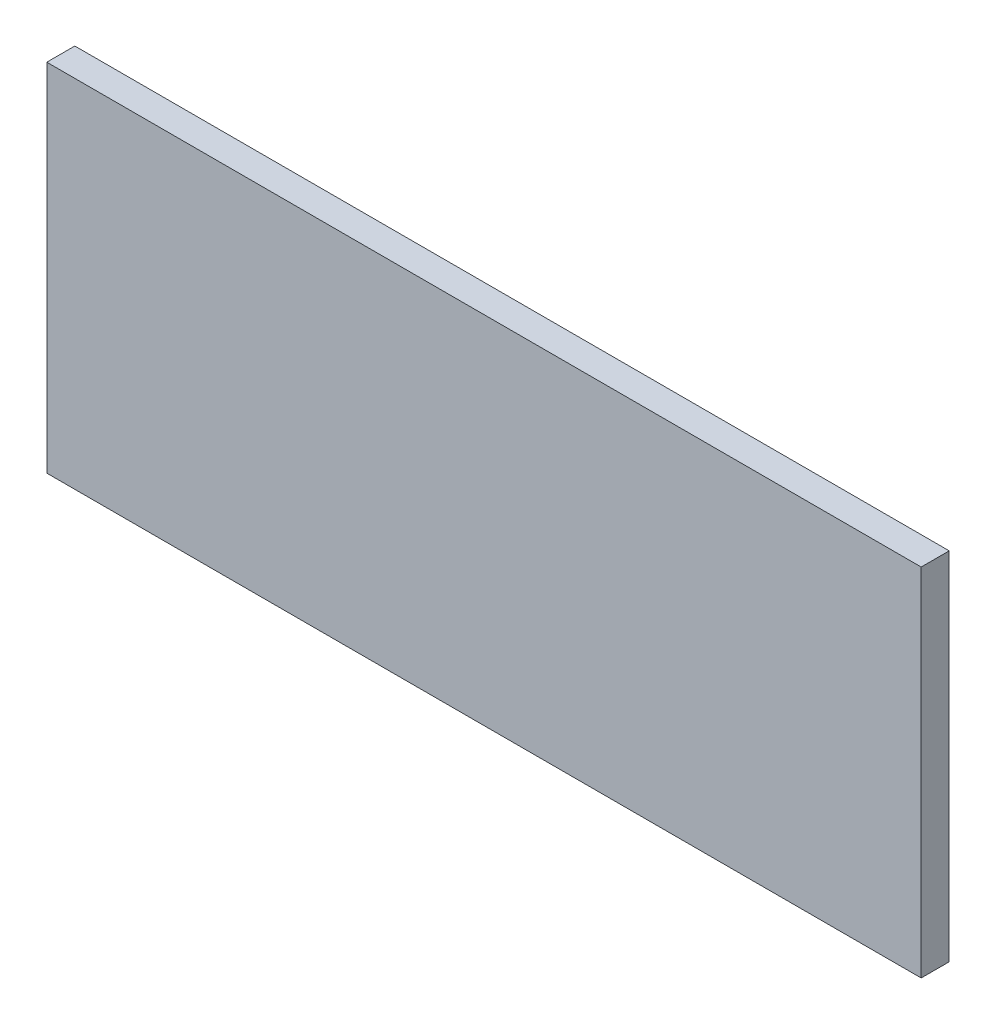
ISO-10303-21;
HEADER;
FILE_DESCRIPTION(('STEP AP214'),'2;1');
FILE_NAME('part.step','',(''),(''),'','','');
FILE_SCHEMA(('AUTOMOTIVE_DESIGN { 1 0 10303 214 1 1 1 1 }'));
ENDSEC;
DATA;
#1=APPLICATION_CONTEXT('core data for automotive mechanical design processes');
#2=APPLICATION_PROTOCOL_DEFINITION('international standard','automotive_design',2000,#1);
#3=PRODUCT_CONTEXT('',#1,'mechanical');
#4=PRODUCT('Part','Part','',(#3));
#5=PRODUCT_RELATED_PRODUCT_CATEGORY('part','',(#4));
#6=PRODUCT_DEFINITION_FORMATION('','',#4);
#7=PRODUCT_DEFINITION_CONTEXT('part definition',#1,'design');
#8=PRODUCT_DEFINITION('design','',#6,#7);
#9=PRODUCT_DEFINITION_SHAPE('','',#8);
#10=(LENGTH_UNIT() NAMED_UNIT(*) SI_UNIT(.MILLI.,.METRE.));
#11=(NAMED_UNIT(*) PLANE_ANGLE_UNIT() SI_UNIT($,.RADIAN.));
#12=(NAMED_UNIT(*) SI_UNIT($,.STERADIAN.) SOLID_ANGLE_UNIT());
#13=UNCERTAINTY_MEASURE_WITH_UNIT(LENGTH_MEASURE(1.E-05),#10,'distance_accuracy_value','');
#14=(GEOMETRIC_REPRESENTATION_CONTEXT(3) GLOBAL_UNCERTAINTY_ASSIGNED_CONTEXT((#13)) GLOBAL_UNIT_ASSIGNED_CONTEXT((#10,
#11,#12)) REPRESENTATION_CONTEXT('',''));
#15=CARTESIAN_POINT('',(0.,0.,0.));
#16=DIRECTION('',(0.,0.,1.));
#17=DIRECTION('',(1.,0.,0.));
#18=AXIS2_PLACEMENT_3D('',#15,#16,#17);
#19=CARTESIAN_POINT('',(-355.778571570737,50.708764749836,10.));
#20=DIRECTION('',(1.,0.,0.));
#21=DIRECTION('',(0.,0.,-1.));
#22=AXIS2_PLACEMENT_3D('',#19,#20,#21);
#23=PLANE('',#22);
#24=DIRECTION('',(0.,-1.,0.));
#25=VECTOR('',#24,1.);
#26=CARTESIAN_POINT('',(-355.778571570737,50.708764749836,0.));
#27=LINE('',#26,#25);
#28=CARTESIAN_POINT('',(-355.778571570737,50.708764749836,0.));
#29=VERTEX_POINT('',#28);
#30=CARTESIAN_POINT('',(-355.778571570737,-76.291235250164,0.));
#31=VERTEX_POINT('',#30);
#32=EDGE_CURVE('E113',#29,#31,#27,.T.);
#33=ORIENTED_EDGE('',*,*,#32,.T.);
#34=DIRECTION('',(0.,0.,-1.));
#35=VECTOR('',#34,1.);
#36=CARTESIAN_POINT('',(-355.778571570737,-76.291235250164,10.));
#37=LINE('',#36,#35);
#38=CARTESIAN_POINT('',(-355.778571570737,-76.291235250164,10.));
#39=VERTEX_POINT('',#38);
#40=EDGE_CURVE('E11',#39,#31,#37,.T.);
#41=ORIENTED_EDGE('',*,*,#40,.F.);
#42=DIRECTION('',(0.,-1.,0.));
#43=VECTOR('',#42,1.);
#44=CARTESIAN_POINT('',(-355.778571570737,50.708764749836,10.));
#45=LINE('',#44,#43);
#46=CARTESIAN_POINT('',(-355.778571570737,50.708764749836,10.));
#47=VERTEX_POINT('',#46);
#48=EDGE_CURVE('E97',#47,#39,#45,.T.);
#49=ORIENTED_EDGE('',*,*,#48,.F.);
#50=DIRECTION('',(0.,0.,-1.));
#51=VECTOR('',#50,1.);
#52=CARTESIAN_POINT('',(-355.778571570737,50.708764749836,10.));
#53=LINE('',#52,#51);
#54=EDGE_CURVE('E109',#47,#29,#53,.T.);
#55=ORIENTED_EDGE('',*,*,#54,.T.);
#56=EDGE_LOOP('',(#33,#41,#49,#55));
#57=FACE_BOUND('',#56,.T.);
#58=ADVANCED_FACE('F45',(#57),#23,.F.);
#59=CARTESIAN_POINT('',(-355.778571570737,-76.291235250164,10.));
#60=DIRECTION('',(0.,1.,0.));
#61=DIRECTION('',(0.,0.,1.));
#62=AXIS2_PLACEMENT_3D('',#59,#60,#61);
#63=PLANE('',#62);
#64=DIRECTION('',(1.,0.,0.));
#65=VECTOR('',#64,1.);
#66=CARTESIAN_POINT('',(-355.778571570737,-76.291235250164,0.));
#67=LINE('',#66,#65);
#68=CARTESIAN_POINT('',(-43.7785715707367,-76.291235250164,0.));
#69=VERTEX_POINT('',#68);
#70=EDGE_CURVE('E102',#31,#69,#67,.T.);
#71=ORIENTED_EDGE('',*,*,#70,.T.);
#72=DIRECTION('',(0.,0.,-1.));
#73=VECTOR('',#72,1.);
#74=CARTESIAN_POINT('',(-43.7785715707367,-76.291235250164,10.));
#75=LINE('',#74,#73);
#76=CARTESIAN_POINT('',(-43.7785715707367,-76.291235250164,10.));
#77=VERTEX_POINT('',#76);
#78=EDGE_CURVE('E54',#77,#69,#75,.T.);
#79=ORIENTED_EDGE('',*,*,#78,.F.);
#80=DIRECTION('',(1.,0.,0.));
#81=VECTOR('',#80,1.);
#82=CARTESIAN_POINT('',(-355.778571570737,-76.291235250164,10.));
#83=LINE('',#82,#81);
#84=EDGE_CURVE('E92',#39,#77,#83,.T.);
#85=ORIENTED_EDGE('',*,*,#84,.F.);
#86=ORIENTED_EDGE('',*,*,#40,.T.);
#87=EDGE_LOOP('',(#71,#79,#85,#86));
#88=FACE_BOUND('',#87,.T.);
#89=ADVANCED_FACE('F101',(#88),#63,.F.);
#90=CARTESIAN_POINT('',(-43.7785715707367,50.708764749836,10.));
#91=DIRECTION('',(-1.,0.,0.));
#92=DIRECTION('',(0.,0.,1.));
#93=AXIS2_PLACEMENT_3D('',#90,#91,#92);
#94=PLANE('',#93);
#95=DIRECTION('',(0.,1.,0.));
#96=VECTOR('',#95,1.);
#97=CARTESIAN_POINT('',(-43.7785715707367,50.708764749836,0.));
#98=LINE('',#97,#96);
#99=CARTESIAN_POINT('',(-43.7785715707367,50.708764749836,0.));
#100=VERTEX_POINT('',#99);
#101=EDGE_CURVE('E79',#69,#100,#98,.T.);
#102=ORIENTED_EDGE('',*,*,#101,.T.);
#103=DIRECTION('',(0.,0.,-1.));
#104=VECTOR('',#103,1.);
#105=CARTESIAN_POINT('',(-43.7785715707367,50.708764749836,10.));
#106=LINE('',#105,#104);
#107=CARTESIAN_POINT('',(-43.7785715707367,50.708764749836,10.));
#108=VERTEX_POINT('',#107);
#109=EDGE_CURVE('E104',#108,#100,#106,.T.);
#110=ORIENTED_EDGE('',*,*,#109,.F.);
#111=DIRECTION('',(0.,1.,0.));
#112=VECTOR('',#111,1.);
#113=CARTESIAN_POINT('',(-43.7785715707367,50.708764749836,10.));
#114=LINE('',#113,#112);
#115=EDGE_CURVE('E95',#77,#108,#114,.T.);
#116=ORIENTED_EDGE('',*,*,#115,.F.);
#117=ORIENTED_EDGE('',*,*,#78,.T.);
#118=EDGE_LOOP('',(#102,#110,#116,#117));
#119=FACE_BOUND('',#118,.T.);
#120=ADVANCED_FACE('F105',(#119),#94,.F.);
#121=CARTESIAN_POINT('',(-355.778571570737,50.708764749836,10.));
#122=DIRECTION('',(0.,-1.,0.));
#123=DIRECTION('',(0.,0.,-1.));
#124=AXIS2_PLACEMENT_3D('',#121,#122,#123);
#125=PLANE('',#124);
#126=DIRECTION('',(-1.,0.,0.));
#127=VECTOR('',#126,1.);
#128=CARTESIAN_POINT('',(-355.778571570737,50.708764749836,0.));
#129=LINE('',#128,#127);
#130=EDGE_CURVE('E85',#100,#29,#129,.T.);
#131=ORIENTED_EDGE('',*,*,#130,.T.);
#132=ORIENTED_EDGE('',*,*,#54,.F.);
#133=DIRECTION('',(-1.,0.,0.));
#134=VECTOR('',#133,1.);
#135=CARTESIAN_POINT('',(-355.778571570737,50.708764749836,10.));
#136=LINE('',#135,#134);
#137=EDGE_CURVE('E62',#108,#47,#136,.T.);
#138=ORIENTED_EDGE('',*,*,#137,.F.);
#139=ORIENTED_EDGE('',*,*,#109,.T.);
#140=EDGE_LOOP('',(#131,#132,#138,#139));
#141=FACE_BOUND('',#140,.T.);
#142=ADVANCED_FACE('F126',(#141),#125,.F.);
#143=CARTESIAN_POINT('',(0.,0.,10.));
#144=DIRECTION('',(0.,0.,1.));
#145=DIRECTION('',(1.,0.,0.));
#146=AXIS2_PLACEMENT_3D('',#143,#144,#145);
#147=PLANE('',#146);
#148=ORIENTED_EDGE('',*,*,#48,.T.);
#149=ORIENTED_EDGE('',*,*,#84,.T.);
#150=ORIENTED_EDGE('',*,*,#115,.T.);
#151=ORIENTED_EDGE('',*,*,#137,.T.);
#152=EDGE_LOOP('',(#148,#149,#150,#151));
#153=FACE_BOUND('',#152,.T.);
#154=ADVANCED_FACE('F93',(#153),#147,.T.);
#155=CARTESIAN_POINT('',(0.,0.,0.));
#156=DIRECTION('',(0.,0.,1.));
#157=DIRECTION('',(1.,0.,0.));
#158=AXIS2_PLACEMENT_3D('',#155,#156,#157);
#159=PLANE('',#158);
#160=ORIENTED_EDGE('',*,*,#32,.F.);
#161=ORIENTED_EDGE('',*,*,#130,.F.);
#162=ORIENTED_EDGE('',*,*,#101,.F.);
#163=ORIENTED_EDGE('',*,*,#70,.F.);
#164=EDGE_LOOP('',(#160,#161,#162,#163));
#165=FACE_BOUND('',#164,.T.);
#166=ADVANCED_FACE('F129',(#165),#159,.F.);
#167=CLOSED_SHELL('',(#58,#89,#120,#142,#154,#166));
#168=MANIFOLD_SOLID_BREP('B2',#167);
#169=ADVANCED_BREP_SHAPE_REPRESENTATION('',(#18,#168),#14);
#170=SHAPE_DEFINITION_REPRESENTATION(#9,#169);
ENDSEC;
END-ISO-10303-21;
